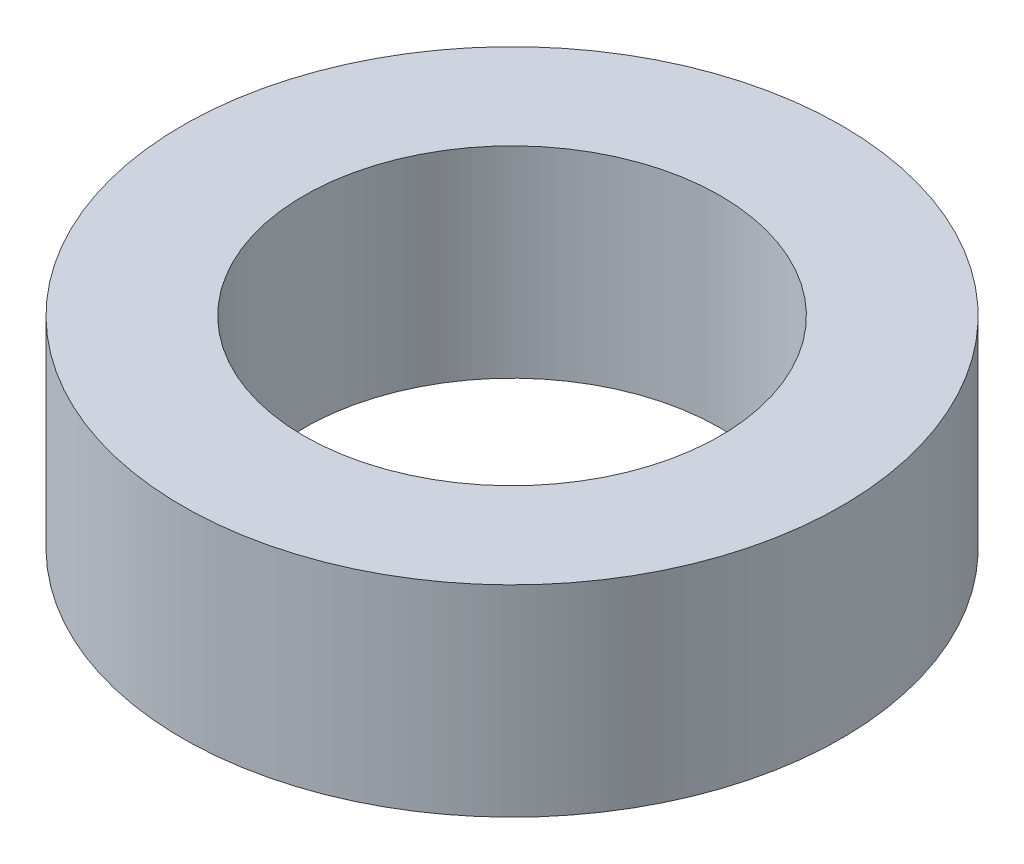
ISO-10303-21;
HEADER;
FILE_DESCRIPTION(('STEP AP214'),'2;1');
FILE_NAME('part.step','',(''),(''),'','','');
FILE_SCHEMA(('AUTOMOTIVE_DESIGN { 1 0 10303 214 1 1 1 1 }'));
ENDSEC;
DATA;
#1=APPLICATION_CONTEXT('core data for automotive mechanical design processes');
#2=APPLICATION_PROTOCOL_DEFINITION('international standard','automotive_design',2000,#1);
#3=PRODUCT_CONTEXT('',#1,'mechanical');
#4=PRODUCT('Part','Part','',(#3));
#5=PRODUCT_RELATED_PRODUCT_CATEGORY('part','',(#4));
#6=PRODUCT_DEFINITION_FORMATION('','',#4);
#7=PRODUCT_DEFINITION_CONTEXT('part definition',#1,'design');
#8=PRODUCT_DEFINITION('design','',#6,#7);
#9=PRODUCT_DEFINITION_SHAPE('','',#8);
#10=(LENGTH_UNIT() NAMED_UNIT(*) SI_UNIT(.MILLI.,.METRE.));
#11=(NAMED_UNIT(*) PLANE_ANGLE_UNIT() SI_UNIT($,.RADIAN.));
#12=(NAMED_UNIT(*) SI_UNIT($,.STERADIAN.) SOLID_ANGLE_UNIT());
#13=UNCERTAINTY_MEASURE_WITH_UNIT(LENGTH_MEASURE(1.E-05),#10,'distance_accuracy_value','');
#14=(GEOMETRIC_REPRESENTATION_CONTEXT(3) GLOBAL_UNCERTAINTY_ASSIGNED_CONTEXT((#13)) GLOBAL_UNIT_ASSIGNED_CONTEXT((#10,
#11,#12)) REPRESENTATION_CONTEXT('',''));
#15=CARTESIAN_POINT('',(0.,0.,0.));
#16=DIRECTION('',(0.,0.,1.));
#17=DIRECTION('',(1.,0.,0.));
#18=AXIS2_PLACEMENT_3D('',#15,#16,#17);
#19=CARTESIAN_POINT('',(0.,29.,0.));
#20=DIRECTION('',(0.,-1.,0.));
#21=DIRECTION('',(0.,0.,-1.));
#22=AXIS2_PLACEMENT_3D('',#19,#20,#21);
#23=CYLINDRICAL_SURFACE('',#22,47.5);
#24=CARTESIAN_POINT('',(0.,29.,0.));
#25=DIRECTION('',(0.,1.,0.));
#26=DIRECTION('',(0.,0.,1.));
#27=AXIS2_PLACEMENT_3D('',#24,#25,#26);
#28=CIRCLE('',#27,47.5);
#29=CARTESIAN_POINT('',(0.,29.,-47.5));
#30=VERTEX_POINT('',#29);
#31=EDGE_CURVE('E10',#30,#30,#28,.T.);
#32=CARTESIAN_POINT('',(0.,0.,0.));
#33=DIRECTION('',(0.,1.,0.));
#34=DIRECTION('',(0.,0.,1.));
#35=AXIS2_PLACEMENT_3D('',#32,#33,#34);
#36=CIRCLE('',#35,47.5);
#37=CARTESIAN_POINT('',(0.,0.,-47.5));
#38=VERTEX_POINT('',#37);
#39=EDGE_CURVE('E37',#38,#38,#36,.T.);
#40=CARTESIAN_POINT('',(0.,29.,-47.5));
#41=CARTESIAN_POINT('',(0.,28.6979166666667,-47.5));
#42=CARTESIAN_POINT('',(0.,28.3958333333333,-47.5));
#43=CARTESIAN_POINT('',(0.,27.7916666666667,-47.5));
#44=CARTESIAN_POINT('',(0.,27.4895833333333,-47.5));
#45=CARTESIAN_POINT('',(0.,26.8854166666667,-47.5));
#46=CARTESIAN_POINT('',(0.,26.5833333333333,-47.5));
#47=CARTESIAN_POINT('',(0.,25.9791666666667,-47.5));
#48=CARTESIAN_POINT('',(0.,25.6770833333333,-47.5));
#49=CARTESIAN_POINT('',(0.,25.0729166666667,-47.5));
#50=CARTESIAN_POINT('',(0.,24.7708333333333,-47.5));
#51=CARTESIAN_POINT('',(0.,24.1666666666667,-47.5));
#52=CARTESIAN_POINT('',(0.,23.8645833333333,-47.5));
#53=CARTESIAN_POINT('',(0.,23.2604166666667,-47.5));
#54=CARTESIAN_POINT('',(0.,22.9583333333333,-47.5));
#55=CARTESIAN_POINT('',(0.,22.3541666666667,-47.5));
#56=CARTESIAN_POINT('',(0.,22.0520833333333,-47.5));
#57=CARTESIAN_POINT('',(0.,21.4479166666667,-47.5));
#58=CARTESIAN_POINT('',(0.,21.1458333333333,-47.5));
#59=CARTESIAN_POINT('',(0.,20.5416666666667,-47.5));
#60=CARTESIAN_POINT('',(0.,20.2395833333333,-47.5));
#61=CARTESIAN_POINT('',(0.,19.6354166666667,-47.5));
#62=CARTESIAN_POINT('',(0.,19.3333333333333,-47.5));
#63=CARTESIAN_POINT('',(0.,18.7291666666667,-47.5));
#64=CARTESIAN_POINT('',(0.,18.4270833333333,-47.5));
#65=CARTESIAN_POINT('',(0.,17.8229166666667,-47.5));
#66=CARTESIAN_POINT('',(0.,17.5208333333333,-47.5));
#67=CARTESIAN_POINT('',(0.,16.9166666666667,-47.5));
#68=CARTESIAN_POINT('',(0.,16.6145833333333,-47.5));
#69=CARTESIAN_POINT('',(0.,16.0104166666667,-47.5));
#70=CARTESIAN_POINT('',(0.,15.7083333333333,-47.5));
#71=CARTESIAN_POINT('',(0.,15.1041666666667,-47.5));
#72=CARTESIAN_POINT('',(0.,14.8020833333333,-47.5));
#73=CARTESIAN_POINT('',(0.,14.1979166666667,-47.5));
#74=CARTESIAN_POINT('',(0.,13.8958333333333,-47.5));
#75=CARTESIAN_POINT('',(0.,13.2916666666667,-47.5));
#76=CARTESIAN_POINT('',(0.,12.9895833333333,-47.5));
#77=CARTESIAN_POINT('',(0.,12.3854166666667,-47.5));
#78=CARTESIAN_POINT('',(0.,12.0833333333333,-47.5));
#79=CARTESIAN_POINT('',(0.,11.4791666666667,-47.5));
#80=CARTESIAN_POINT('',(0.,11.1770833333333,-47.5));
#81=CARTESIAN_POINT('',(0.,10.5729166666667,-47.5));
#82=CARTESIAN_POINT('',(0.,10.2708333333333,-47.5));
#83=CARTESIAN_POINT('',(0.,9.66666666666667,-47.5));
#84=CARTESIAN_POINT('',(0.,9.36458333333333,-47.5));
#85=CARTESIAN_POINT('',(0.,8.76041666666667,-47.5));
#86=CARTESIAN_POINT('',(0.,8.45833333333333,-47.5));
#87=CARTESIAN_POINT('',(0.,7.85416666666667,-47.5));
#88=CARTESIAN_POINT('',(0.,7.55208333333333,-47.5));
#89=CARTESIAN_POINT('',(0.,6.94791666666667,-47.5));
#90=CARTESIAN_POINT('',(0.,6.64583333333333,-47.5));
#91=CARTESIAN_POINT('',(0.,6.04166666666667,-47.5));
#92=CARTESIAN_POINT('',(0.,5.73958333333333,-47.5));
#93=CARTESIAN_POINT('',(0.,5.13541666666667,-47.5));
#94=CARTESIAN_POINT('',(0.,4.83333333333333,-47.5));
#95=CARTESIAN_POINT('',(0.,4.22916666666667,-47.5));
#96=CARTESIAN_POINT('',(0.,3.92708333333333,-47.5));
#97=CARTESIAN_POINT('',(0.,3.32291666666667,-47.5));
#98=CARTESIAN_POINT('',(0.,3.02083333333333,-47.5));
#99=CARTESIAN_POINT('',(0.,2.41666666666667,-47.5));
#100=CARTESIAN_POINT('',(0.,2.11458333333333,-47.5));
#101=CARTESIAN_POINT('',(0.,1.51041666666667,-47.5));
#102=CARTESIAN_POINT('',(0.,1.20833333333333,-47.5));
#103=CARTESIAN_POINT('',(0.,0.604166666666667,-47.5));
#104=CARTESIAN_POINT('',(0.,0.302083333333333,-47.5));
#105=CARTESIAN_POINT('',(0.,0.,-47.5));
#106=B_SPLINE_CURVE_WITH_KNOTS('',3,(#40,#41,#42,#43,#44,#45,#46,#47,#48,#49,#50,#51,#52,#53,
#54,#55,#56,#57,#58,#59,#60,#61,#62,#63,#64,#65,#66,#67,#68,#69,#70,#71,#72,#73,#74,#75,#76,#77,
#78,#79,#80,#81,#82,#83,#84,#85,#86,#87,#88,#89,#90,#91,#92,#93,#94,#95,#96,#97,#98,#99,#100,
#101,#102,#103,#104,#105),.UNSPECIFIED.,.F.,.F.,(4,2,2,2,2,2,2,2,2,2,2,2,2,2,2,2,2,2,2,2,2,2,2,
2,2,2,2,2,2,2,2,2,4),(0.,0.906249999999997,1.8125,2.71875,3.625,4.53125,5.4375,6.34375,7.25,
8.15625,9.0625,9.96875,10.875,11.78125,12.6875,13.59375,14.5,15.40625,16.3125,17.21875,18.125,
19.03125,19.9375,20.84375,21.75,22.65625,23.5625,24.46875,25.375,26.28125,27.1875,28.09375,29.),.UNSPECIFIED.);
#107=EDGE_CURVE('BSEAM40',#30,#38,#106,.T.);
#108=ORIENTED_EDGE('',*,*,#31,.F.);
#109=ORIENTED_EDGE('',*,*,#39,.T.);
#110=ORIENTED_EDGE('',*,*,#107,.T.);
#111=ORIENTED_EDGE('',*,*,#107,.F.);
#112=EDGE_LOOP('',(#108,#110,#109,#111));
#113=FACE_BOUND('',#112,.T.);
#114=ADVANCED_FACE('F40',(#113),#23,.T.);
#115=CARTESIAN_POINT('',(0.,29.,0.));
#116=DIRECTION('',(0.,1.,0.));
#117=DIRECTION('',(0.,0.,1.));
#118=AXIS2_PLACEMENT_3D('',#115,#116,#117);
#119=PLANE('',#118);
#120=CARTESIAN_POINT('',(0.,29.,0.));
#121=DIRECTION('',(0.,1.,0.));
#122=DIRECTION('',(0.,0.,1.));
#123=AXIS2_PLACEMENT_3D('',#120,#121,#122);
#124=CIRCLE('',#123,30.);
#125=CARTESIAN_POINT('',(0.,29.,-30.));
#126=VERTEX_POINT('',#125);
#127=EDGE_CURVE('E50',#126,#126,#124,.T.);
#128=ORIENTED_EDGE('',*,*,#127,.F.);
#129=EDGE_LOOP('',(#128));
#130=FACE_BOUND('',#129,.T.);
#131=ORIENTED_EDGE('',*,*,#31,.T.);
#132=EDGE_LOOP('',(#131));
#133=FACE_BOUND('',#132,.T.);
#134=ADVANCED_FACE('F59',(#130,#133),#119,.T.);
#135=CARTESIAN_POINT('',(0.,0.,0.));
#136=DIRECTION('',(0.,1.,0.));
#137=DIRECTION('',(0.,0.,1.));
#138=AXIS2_PLACEMENT_3D('',#135,#136,#137);
#139=PLANE('',#138);
#140=CARTESIAN_POINT('',(0.,0.,0.));
#141=DIRECTION('',(0.,1.,0.));
#142=DIRECTION('',(0.,0.,1.));
#143=AXIS2_PLACEMENT_3D('',#140,#141,#142);
#144=CIRCLE('',#143,30.);
#145=CARTESIAN_POINT('',(0.,0.,-30.));
#146=VERTEX_POINT('',#145);
#147=EDGE_CURVE('E47',#146,#146,#144,.T.);
#148=ORIENTED_EDGE('',*,*,#147,.T.);
#149=EDGE_LOOP('',(#148));
#150=FACE_BOUND('',#149,.T.);
#151=ORIENTED_EDGE('',*,*,#39,.F.);
#152=EDGE_LOOP('',(#151));
#153=FACE_BOUND('',#152,.T.);
#154=ADVANCED_FACE('F58',(#150,#153),#139,.F.);
#155=CARTESIAN_POINT('',(0.,29.,0.));
#156=DIRECTION('',(0.,-1.,0.));
#157=DIRECTION('',(0.,0.,-1.));
#158=AXIS2_PLACEMENT_3D('',#155,#156,#157);
#159=CYLINDRICAL_SURFACE('',#158,30.);
#160=CARTESIAN_POINT('',(0.,29.,-30.));
#161=CARTESIAN_POINT('',(0.,28.6979166666667,-30.));
#162=CARTESIAN_POINT('',(0.,28.3958333333333,-30.));
#163=CARTESIAN_POINT('',(0.,27.7916666666667,-30.));
#164=CARTESIAN_POINT('',(0.,27.4895833333333,-30.));
#165=CARTESIAN_POINT('',(0.,26.8854166666667,-30.));
#166=CARTESIAN_POINT('',(0.,26.5833333333333,-30.));
#167=CARTESIAN_POINT('',(0.,25.9791666666667,-30.));
#168=CARTESIAN_POINT('',(0.,25.6770833333333,-30.));
#169=CARTESIAN_POINT('',(0.,25.0729166666667,-30.));
#170=CARTESIAN_POINT('',(0.,24.7708333333333,-30.));
#171=CARTESIAN_POINT('',(0.,24.1666666666667,-30.));
#172=CARTESIAN_POINT('',(0.,23.8645833333333,-30.));
#173=CARTESIAN_POINT('',(0.,23.2604166666667,-30.));
#174=CARTESIAN_POINT('',(0.,22.9583333333333,-30.));
#175=CARTESIAN_POINT('',(0.,22.3541666666667,-30.));
#176=CARTESIAN_POINT('',(0.,22.0520833333333,-30.));
#177=CARTESIAN_POINT('',(0.,21.4479166666667,-30.));
#178=CARTESIAN_POINT('',(0.,21.1458333333333,-30.));
#179=CARTESIAN_POINT('',(0.,20.5416666666667,-30.));
#180=CARTESIAN_POINT('',(0.,20.2395833333333,-30.));
#181=CARTESIAN_POINT('',(0.,19.6354166666667,-30.));
#182=CARTESIAN_POINT('',(0.,19.3333333333333,-30.));
#183=CARTESIAN_POINT('',(0.,18.7291666666667,-30.));
#184=CARTESIAN_POINT('',(0.,18.4270833333333,-30.));
#185=CARTESIAN_POINT('',(0.,17.8229166666667,-30.));
#186=CARTESIAN_POINT('',(0.,17.5208333333333,-30.));
#187=CARTESIAN_POINT('',(0.,16.9166666666667,-30.));
#188=CARTESIAN_POINT('',(0.,16.6145833333333,-30.));
#189=CARTESIAN_POINT('',(0.,16.0104166666667,-30.));
#190=CARTESIAN_POINT('',(0.,15.7083333333333,-30.));
#191=CARTESIAN_POINT('',(0.,15.1041666666667,-30.));
#192=CARTESIAN_POINT('',(0.,14.8020833333333,-30.));
#193=CARTESIAN_POINT('',(0.,14.1979166666667,-30.));
#194=CARTESIAN_POINT('',(0.,13.8958333333333,-30.));
#195=CARTESIAN_POINT('',(0.,13.2916666666667,-30.));
#196=CARTESIAN_POINT('',(0.,12.9895833333333,-30.));
#197=CARTESIAN_POINT('',(0.,12.3854166666667,-30.));
#198=CARTESIAN_POINT('',(0.,12.0833333333333,-30.));
#199=CARTESIAN_POINT('',(0.,11.4791666666667,-30.));
#200=CARTESIAN_POINT('',(0.,11.1770833333333,-30.));
#201=CARTESIAN_POINT('',(0.,10.5729166666667,-30.));
#202=CARTESIAN_POINT('',(0.,10.2708333333333,-30.));
#203=CARTESIAN_POINT('',(0.,9.66666666666667,-30.));
#204=CARTESIAN_POINT('',(0.,9.36458333333333,-30.));
#205=CARTESIAN_POINT('',(0.,8.76041666666667,-30.));
#206=CARTESIAN_POINT('',(0.,8.45833333333333,-30.));
#207=CARTESIAN_POINT('',(0.,7.85416666666667,-30.));
#208=CARTESIAN_POINT('',(0.,7.55208333333333,-30.));
#209=CARTESIAN_POINT('',(0.,6.94791666666667,-30.));
#210=CARTESIAN_POINT('',(0.,6.64583333333333,-30.));
#211=CARTESIAN_POINT('',(0.,6.04166666666667,-30.));
#212=CARTESIAN_POINT('',(0.,5.73958333333333,-30.));
#213=CARTESIAN_POINT('',(0.,5.13541666666667,-30.));
#214=CARTESIAN_POINT('',(0.,4.83333333333333,-30.));
#215=CARTESIAN_POINT('',(0.,4.22916666666667,-30.));
#216=CARTESIAN_POINT('',(0.,3.92708333333333,-30.));
#217=CARTESIAN_POINT('',(0.,3.32291666666667,-30.));
#218=CARTESIAN_POINT('',(0.,3.02083333333333,-30.));
#219=CARTESIAN_POINT('',(0.,2.41666666666667,-30.));
#220=CARTESIAN_POINT('',(0.,2.11458333333333,-30.));
#221=CARTESIAN_POINT('',(0.,1.51041666666667,-30.));
#222=CARTESIAN_POINT('',(0.,1.20833333333333,-30.));
#223=CARTESIAN_POINT('',(0.,0.604166666666667,-30.));
#224=CARTESIAN_POINT('',(0.,0.302083333333333,-30.));
#225=CARTESIAN_POINT('',(0.,0.,-30.));
#226=B_SPLINE_CURVE_WITH_KNOTS('',3,(#160,#161,#162,#163,#164,#165,#166,#167,#168,#169,#170,
#171,#172,#173,#174,#175,#176,#177,#178,#179,#180,#181,#182,#183,#184,#185,#186,#187,#188,#189,
#190,#191,#192,#193,#194,#195,#196,#197,#198,#199,#200,#201,#202,#203,#204,#205,#206,#207,#208,
#209,#210,#211,#212,#213,#214,#215,#216,#217,#218,#219,#220,#221,#222,#223,#224,#225),
.UNSPECIFIED.,.F.,.F.,(4,2,2,2,2,2,2,2,2,2,2,2,2,2,2,2,2,2,2,2,2,2,2,2,2,2,2,2,2,2,2,2,4),(0.,
0.906249999999997,1.8125,2.71875,3.625,4.53125,5.4375,6.34375,7.25,8.15625,9.0625,9.96875,
10.875,11.78125,12.6875,13.59375,14.5,15.40625,16.3125,17.21875,18.125,19.03125,19.9375,
20.84375,21.75,22.65625,23.5625,24.46875,25.375,26.28125,27.1875,28.09375,29.),.UNSPECIFIED.);
#227=EDGE_CURVE('BSEAM54',#126,#146,#226,.T.);
#228=ORIENTED_EDGE('',*,*,#127,.T.);
#229=ORIENTED_EDGE('',*,*,#147,.F.);
#230=ORIENTED_EDGE('',*,*,#227,.T.);
#231=ORIENTED_EDGE('',*,*,#227,.F.);
#232=EDGE_LOOP('',(#228,#230,#229,#231));
#233=FACE_BOUND('',#232,.T.);
#234=ADVANCED_FACE('F54',(#233),#159,.F.);
#235=CLOSED_SHELL('',(#114,#134,#154,#234));
#236=MANIFOLD_SOLID_BREP('B2',#235);
#237=ADVANCED_BREP_SHAPE_REPRESENTATION('',(#18,#236),#14);
#238=SHAPE_DEFINITION_REPRESENTATION(#9,#237);
ENDSEC;
END-ISO-10303-21;
